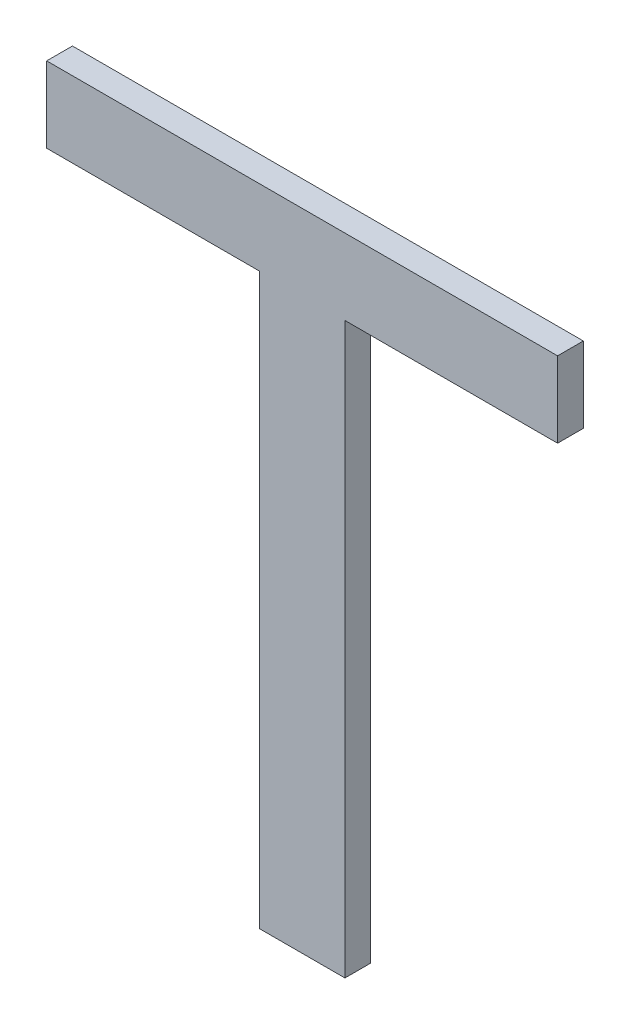
ISO-10303-21;
HEADER;
FILE_DESCRIPTION(('STEP AP214'),'2;1');
FILE_NAME('part.step','',(''),(''),'','','');
FILE_SCHEMA(('AUTOMOTIVE_DESIGN { 1 0 10303 214 1 1 1 1 }'));
ENDSEC;
DATA;
#1=APPLICATION_CONTEXT('core data for automotive mechanical design processes');
#2=APPLICATION_PROTOCOL_DEFINITION('international standard','automotive_design',2000,#1);
#3=PRODUCT_CONTEXT('',#1,'mechanical');
#4=PRODUCT('Part','Part','',(#3));
#5=PRODUCT_RELATED_PRODUCT_CATEGORY('part','',(#4));
#6=PRODUCT_DEFINITION_FORMATION('','',#4);
#7=PRODUCT_DEFINITION_CONTEXT('part definition',#1,'design');
#8=PRODUCT_DEFINITION('design','',#6,#7);
#9=PRODUCT_DEFINITION_SHAPE('','',#8);
#10=(LENGTH_UNIT() NAMED_UNIT(*) SI_UNIT(.MILLI.,.METRE.));
#11=(NAMED_UNIT(*) PLANE_ANGLE_UNIT() SI_UNIT($,.RADIAN.));
#12=(NAMED_UNIT(*) SI_UNIT($,.STERADIAN.) SOLID_ANGLE_UNIT());
#13=UNCERTAINTY_MEASURE_WITH_UNIT(LENGTH_MEASURE(1.E-05),#10,'distance_accuracy_value','');
#14=(GEOMETRIC_REPRESENTATION_CONTEXT(3) GLOBAL_UNCERTAINTY_ASSIGNED_CONTEXT((#13)) GLOBAL_UNIT_ASSIGNED_CONTEXT((#10,
#11,#12)) REPRESENTATION_CONTEXT('',''));
#15=CARTESIAN_POINT('',(0.,0.,0.));
#16=DIRECTION('',(0.,0.,1.));
#17=DIRECTION('',(1.,0.,0.));
#18=AXIS2_PLACEMENT_3D('',#15,#16,#17);
#19=CARTESIAN_POINT('',(-1.950772891939,0.0543411377222901,1.59999999404));
#20=DIRECTION('',(0.,0.,1.));
#21=DIRECTION('',(1.,0.,0.));
#22=AXIS2_PLACEMENT_3D('',#19,#20,#21);
#23=PLANE('',#22);
#24=DIRECTION('',(0.,1.,0.));
#25=VECTOR('',#24,1.);
#26=CARTESIAN_POINT('',(-1.752322901785,0.194164329953,1.59999999404));
#27=LINE('',#26,#25);
#28=CARTESIAN_POINT('',(-1.752322901785,0.223564329371,1.59999999404));
#29=VERTEX_POINT('',#28);
#30=CARTESIAN_POINT('',(-1.752322901785,0.164764330536,1.59999999404));
#31=VERTEX_POINT('',#30);
#32=EDGE_CURVE('E106',#29,#31,#27,.F.);
#33=ORIENTED_EDGE('',*,*,#32,.F.);
#34=DIRECTION('',(1.,0.,0.));
#35=VECTOR('',#34,1.);
#36=CARTESIAN_POINT('',(-1.950772891939,0.223564329371,1.59999999404));
#37=LINE('',#36,#35);
#38=CARTESIAN_POINT('',(-2.149222882092,0.223564329371,1.59999999404));
#39=VERTEX_POINT('',#38);
#40=EDGE_CURVE('E110',#39,#29,#37,.T.);
#41=ORIENTED_EDGE('',*,*,#40,.F.);
#42=DIRECTION('',(0.,1.,0.));
#43=VECTOR('',#42,1.);
#44=CARTESIAN_POINT('',(-2.149222882092,0.194164329953,1.59999999404));
#45=LINE('',#44,#43);
#46=CARTESIAN_POINT('',(-2.149222882092,0.164764330536,1.59999999404));
#47=VERTEX_POINT('',#46);
#48=EDGE_CURVE('E114',#47,#39,#45,.T.);
#49=ORIENTED_EDGE('',*,*,#48,.F.);
#50=DIRECTION('',(1.,0.,0.));
#51=VECTOR('',#50,1.);
#52=CARTESIAN_POINT('',(-2.066622848809,0.164764330536,1.59999999404));
#53=LINE('',#52,#51);
#54=CARTESIAN_POINT('',(-1.984022815526,0.164764330536,1.59999999404));
#55=VERTEX_POINT('',#54);
#56=EDGE_CURVE('E118',#55,#47,#53,.F.);
#57=ORIENTED_EDGE('',*,*,#56,.F.);
#58=DIRECTION('',(0.,1.,0.));
#59=VECTOR('',#58,1.);
#60=CARTESIAN_POINT('',(-1.984022815526,-0.0564356695860601,1.59999999404));
#61=LINE('',#60,#59);
#62=CARTESIAN_POINT('',(-1.984022815526,-0.277635669708,1.59999999404));
#63=VERTEX_POINT('',#62);
#64=EDGE_CURVE('E95',#63,#55,#61,.T.);
#65=ORIENTED_EDGE('',*,*,#64,.F.);
#66=DIRECTION('',(1.,0.,0.));
#67=VECTOR('',#66,1.);
#68=CARTESIAN_POINT('',(-1.950772891939,-0.277635669708,1.59999999404));
#69=LINE('',#68,#67);
#70=CARTESIAN_POINT('',(-1.917522968352,-0.277635669708,1.59999999404));
#71=VERTEX_POINT('',#70);
#72=EDGE_CURVE('E20',#71,#63,#69,.F.);
#73=ORIENTED_EDGE('',*,*,#72,.F.);
#74=DIRECTION('',(0.,1.,0.));
#75=VECTOR('',#74,1.);
#76=CARTESIAN_POINT('',(-1.917522968352,-0.05643566958606,1.59999999404));
#77=LINE('',#76,#75);
#78=CARTESIAN_POINT('',(-1.917522968352,0.164764330536,1.59999999404));
#79=VERTEX_POINT('',#78);
#80=EDGE_CURVE('E83',#79,#71,#77,.F.);
#81=ORIENTED_EDGE('',*,*,#80,.F.);
#82=DIRECTION('',(1.,0.,0.));
#83=VECTOR('',#82,1.);
#84=CARTESIAN_POINT('',(-1.834922935069,0.164764330536,1.59999999404));
#85=LINE('',#84,#83);
#86=EDGE_CURVE('E78',#31,#79,#85,.F.);
#87=ORIENTED_EDGE('',*,*,#86,.F.);
#88=EDGE_LOOP('',(#33,#41,#49,#57,#65,#73,#81,#87));
#89=FACE_BOUND('',#88,.T.);
#90=ADVANCED_FACE('F17',(#89),#23,.T.);
#91=CARTESIAN_POINT('',(-1.950772891939,-0.277635669708,1.59999999404));
#92=DIRECTION('',(0.,-1.,0.));
#93=DIRECTION('',(0.,0.,-1.));
#94=AXIS2_PLACEMENT_3D('',#91,#92,#93);
#95=PLANE('',#94);
#96=DIRECTION('',(1.,0.,0.));
#97=VECTOR('',#96,1.);
#98=CARTESIAN_POINT('',(-1.950772891939,-0.277635669708,1.57999999404));
#99=LINE('',#98,#97);
#100=CARTESIAN_POINT('',(-1.984022815526,-0.277635669708,1.57999999404));
#101=VERTEX_POINT('',#100);
#102=CARTESIAN_POINT('',(-1.917522968352,-0.277635669708,1.57999999404));
#103=VERTEX_POINT('',#102);
#104=EDGE_CURVE('E101',#101,#103,#99,.T.);
#105=ORIENTED_EDGE('',*,*,#104,.T.);
#106=DIRECTION('',(0.,0.,-1.));
#107=VECTOR('',#106,1.);
#108=CARTESIAN_POINT('',(-1.917522968352,-0.277635669708,1.59999999404));
#109=LINE('',#108,#107);
#110=EDGE_CURVE('E88',#71,#103,#109,.T.);
#111=ORIENTED_EDGE('',*,*,#110,.F.);
#112=ORIENTED_EDGE('',*,*,#72,.T.);
#113=DIRECTION('',(0.,0.,1.));
#114=VECTOR('',#113,1.);
#115=CARTESIAN_POINT('',(-1.984022815526,-0.277635669708,1.59999999404));
#116=LINE('',#115,#114);
#117=EDGE_CURVE('E124',#101,#63,#116,.T.);
#118=ORIENTED_EDGE('',*,*,#117,.F.);
#119=EDGE_LOOP('',(#105,#111,#112,#118));
#120=FACE_BOUND('',#119,.T.);
#121=ADVANCED_FACE('F100',(#120),#95,.T.);
#122=CARTESIAN_POINT('',(-1.917522968352,-0.05643566958606,1.59999999404));
#123=DIRECTION('',(1.,0.,0.));
#124=DIRECTION('',(0.,0.,-1.));
#125=AXIS2_PLACEMENT_3D('',#122,#123,#124);
#126=PLANE('',#125);
#127=DIRECTION('',(0.,1.,0.));
#128=VECTOR('',#127,1.);
#129=CARTESIAN_POINT('',(-1.917522968352,0.0543411377222901,1.57999999404));
#130=LINE('',#129,#128);
#131=CARTESIAN_POINT('',(-1.917522968352,0.164764330536,1.57999999404));
#132=VERTEX_POINT('',#131);
#133=EDGE_CURVE('E127',#103,#132,#130,.T.);
#134=ORIENTED_EDGE('',*,*,#133,.T.);
#135=DIRECTION('',(0.,0.,-1.));
#136=VECTOR('',#135,1.);
#137=CARTESIAN_POINT('',(-1.917522968352,0.164764330536,1.59999999404));
#138=LINE('',#137,#136);
#139=EDGE_CURVE('E90',#79,#132,#138,.T.);
#140=ORIENTED_EDGE('',*,*,#139,.F.);
#141=ORIENTED_EDGE('',*,*,#80,.T.);
#142=ORIENTED_EDGE('',*,*,#110,.T.);
#143=EDGE_LOOP('',(#134,#140,#141,#142));
#144=FACE_BOUND('',#143,.T.);
#145=ADVANCED_FACE('F86',(#144),#126,.T.);
#146=CARTESIAN_POINT('',(-1.834922935069,0.164764330536,1.59999999404));
#147=DIRECTION('',(0.,-1.,0.));
#148=DIRECTION('',(0.,0.,-1.));
#149=AXIS2_PLACEMENT_3D('',#146,#147,#148);
#150=PLANE('',#149);
#151=DIRECTION('',(1.,0.,0.));
#152=VECTOR('',#151,1.);
#153=CARTESIAN_POINT('',(-1.950772891939,0.164764330536,1.57999999404));
#154=LINE('',#153,#152);
#155=CARTESIAN_POINT('',(-1.752322901785,0.164764330536,1.57999999404));
#156=VERTEX_POINT('',#155);
#157=EDGE_CURVE('E129',#132,#156,#154,.T.);
#158=ORIENTED_EDGE('',*,*,#157,.T.);
#159=DIRECTION('',(0.,0.,-1.));
#160=VECTOR('',#159,1.);
#161=CARTESIAN_POINT('',(-1.752322901785,0.164764330536,1.59999999404));
#162=LINE('',#161,#160);
#163=EDGE_CURVE('E108',#31,#156,#162,.T.);
#164=ORIENTED_EDGE('',*,*,#163,.F.);
#165=ORIENTED_EDGE('',*,*,#86,.T.);
#166=ORIENTED_EDGE('',*,*,#139,.T.);
#167=EDGE_LOOP('',(#158,#164,#165,#166));
#168=FACE_BOUND('',#167,.T.);
#169=ADVANCED_FACE('F162',(#168),#150,.T.);
#170=CARTESIAN_POINT('',(-1.752322901785,0.194164329953,1.59999999404));
#171=DIRECTION('',(1.,0.,0.));
#172=DIRECTION('',(0.,0.,-1.));
#173=AXIS2_PLACEMENT_3D('',#170,#171,#172);
#174=PLANE('',#173);
#175=DIRECTION('',(0.,1.,0.));
#176=VECTOR('',#175,1.);
#177=CARTESIAN_POINT('',(-1.752322901785,0.0543411377222901,1.57999999404));
#178=LINE('',#177,#176);
#179=CARTESIAN_POINT('',(-1.752322901785,0.223564329371,1.57999999404));
#180=VERTEX_POINT('',#179);
#181=EDGE_CURVE('E132',#156,#180,#178,.T.);
#182=ORIENTED_EDGE('',*,*,#181,.T.);
#183=DIRECTION('',(0.,0.,1.));
#184=VECTOR('',#183,1.);
#185=CARTESIAN_POINT('',(-1.752322901785,0.223564329371,1.59999999404));
#186=LINE('',#185,#184);
#187=EDGE_CURVE('E112',#29,#180,#186,.F.);
#188=ORIENTED_EDGE('',*,*,#187,.F.);
#189=ORIENTED_EDGE('',*,*,#32,.T.);
#190=ORIENTED_EDGE('',*,*,#163,.T.);
#191=EDGE_LOOP('',(#182,#188,#189,#190));
#192=FACE_BOUND('',#191,.T.);
#193=ADVANCED_FACE('F161',(#192),#174,.T.);
#194=CARTESIAN_POINT('',(-1.950772891939,0.223564329371,1.59999999404));
#195=DIRECTION('',(0.,1.,0.));
#196=DIRECTION('',(0.,0.,1.));
#197=AXIS2_PLACEMENT_3D('',#194,#195,#196);
#198=PLANE('',#197);
#199=DIRECTION('',(1.,0.,0.));
#200=VECTOR('',#199,1.);
#201=CARTESIAN_POINT('',(-1.950772891939,0.223564329371,1.57999999404));
#202=LINE('',#201,#200);
#203=CARTESIAN_POINT('',(-2.149222882092,0.223564329371,1.57999999404));
#204=VERTEX_POINT('',#203);
#205=EDGE_CURVE('E135',#180,#204,#202,.F.);
#206=ORIENTED_EDGE('',*,*,#205,.T.);
#207=DIRECTION('',(0.,0.,1.));
#208=VECTOR('',#207,1.);
#209=CARTESIAN_POINT('',(-2.149222882092,0.223564329371,1.59999999404));
#210=LINE('',#209,#208);
#211=EDGE_CURVE('E116',#39,#204,#210,.F.);
#212=ORIENTED_EDGE('',*,*,#211,.F.);
#213=ORIENTED_EDGE('',*,*,#40,.T.);
#214=ORIENTED_EDGE('',*,*,#187,.T.);
#215=EDGE_LOOP('',(#206,#212,#213,#214));
#216=FACE_BOUND('',#215,.T.);
#217=ADVANCED_FACE('F156',(#216),#198,.T.);
#218=CARTESIAN_POINT('',(-2.149222882092,0.194164329953,1.59999999404));
#219=DIRECTION('',(-1.,0.,0.));
#220=DIRECTION('',(0.,0.,1.));
#221=AXIS2_PLACEMENT_3D('',#218,#219,#220);
#222=PLANE('',#221);
#223=DIRECTION('',(0.,1.,0.));
#224=VECTOR('',#223,1.);
#225=CARTESIAN_POINT('',(-2.149222882092,0.0543411377222902,1.57999999404));
#226=LINE('',#225,#224);
#227=CARTESIAN_POINT('',(-2.149222882092,0.164764330536,1.57999999404));
#228=VERTEX_POINT('',#227);
#229=EDGE_CURVE('E138',#204,#228,#226,.F.);
#230=ORIENTED_EDGE('',*,*,#229,.T.);
#231=DIRECTION('',(0.,0.,-1.));
#232=VECTOR('',#231,1.);
#233=CARTESIAN_POINT('',(-2.149222882092,0.164764330536,1.59999999404));
#234=LINE('',#233,#232);
#235=EDGE_CURVE('E120',#47,#228,#234,.T.);
#236=ORIENTED_EDGE('',*,*,#235,.F.);
#237=ORIENTED_EDGE('',*,*,#48,.T.);
#238=ORIENTED_EDGE('',*,*,#211,.T.);
#239=EDGE_LOOP('',(#230,#236,#237,#238));
#240=FACE_BOUND('',#239,.T.);
#241=ADVANCED_FACE('F151',(#240),#222,.T.);
#242=CARTESIAN_POINT('',(-2.066622848809,0.164764330536,1.59999999404));
#243=DIRECTION('',(0.,-1.,0.));
#244=DIRECTION('',(0.,0.,-1.));
#245=AXIS2_PLACEMENT_3D('',#242,#243,#244);
#246=PLANE('',#245);
#247=DIRECTION('',(1.,0.,0.));
#248=VECTOR('',#247,1.);
#249=CARTESIAN_POINT('',(-1.950772891939,0.164764330536,1.57999999404));
#250=LINE('',#249,#248);
#251=CARTESIAN_POINT('',(-1.984022815526,0.164764330536,1.57999999404));
#252=VERTEX_POINT('',#251);
#253=EDGE_CURVE('E26',#228,#252,#250,.T.);
#254=ORIENTED_EDGE('',*,*,#253,.T.);
#255=DIRECTION('',(0.,0.,1.));
#256=VECTOR('',#255,1.);
#257=CARTESIAN_POINT('',(-1.984022815526,0.164764330536,1.59999999404));
#258=LINE('',#257,#256);
#259=EDGE_CURVE('E34',#55,#252,#258,.F.);
#260=ORIENTED_EDGE('',*,*,#259,.F.);
#261=ORIENTED_EDGE('',*,*,#56,.T.);
#262=ORIENTED_EDGE('',*,*,#235,.T.);
#263=EDGE_LOOP('',(#254,#260,#261,#262));
#264=FACE_BOUND('',#263,.T.);
#265=ADVANCED_FACE('F144',(#264),#246,.T.);
#266=CARTESIAN_POINT('',(-1.984022815526,-0.0564356695860601,1.59999999404));
#267=DIRECTION('',(-1.,0.,0.));
#268=DIRECTION('',(0.,0.,1.));
#269=AXIS2_PLACEMENT_3D('',#266,#267,#268);
#270=PLANE('',#269);
#271=DIRECTION('',(0.,1.,0.));
#272=VECTOR('',#271,1.);
#273=CARTESIAN_POINT('',(-1.984022815526,0.0543411377222902,1.57999999404));
#274=LINE('',#273,#272);
#275=EDGE_CURVE('E11',#252,#101,#274,.F.);
#276=ORIENTED_EDGE('',*,*,#275,.T.);
#277=ORIENTED_EDGE('',*,*,#117,.T.);
#278=ORIENTED_EDGE('',*,*,#64,.T.);
#279=ORIENTED_EDGE('',*,*,#259,.T.);
#280=EDGE_LOOP('',(#276,#277,#278,#279));
#281=FACE_BOUND('',#280,.T.);
#282=ADVANCED_FACE('F163',(#281),#270,.T.);
#283=CARTESIAN_POINT('',(-1.950772891939,0.0543411377222901,1.57999999404));
#284=DIRECTION('',(0.,0.,1.));
#285=DIRECTION('',(1.,0.,0.));
#286=AXIS2_PLACEMENT_3D('',#283,#284,#285);
#287=PLANE('',#286);
#288=ORIENTED_EDGE('',*,*,#253,.F.);
#289=ORIENTED_EDGE('',*,*,#229,.F.);
#290=ORIENTED_EDGE('',*,*,#205,.F.);
#291=ORIENTED_EDGE('',*,*,#181,.F.);
#292=ORIENTED_EDGE('',*,*,#157,.F.);
#293=ORIENTED_EDGE('',*,*,#133,.F.);
#294=ORIENTED_EDGE('',*,*,#104,.F.);
#295=ORIENTED_EDGE('',*,*,#275,.F.);
#296=EDGE_LOOP('',(#288,#289,#290,#291,#292,#293,#294,#295));
#297=FACE_BOUND('',#296,.T.);
#298=ADVANCED_FACE('F148',(#297),#287,.F.);
#299=CLOSED_SHELL('',(#90,#121,#145,#169,#193,#217,#241,#265,#282,#298));
#300=MANIFOLD_SOLID_BREP('B1',#299);
#301=ADVANCED_BREP_SHAPE_REPRESENTATION('',(#18,#300),#14);
#302=SHAPE_DEFINITION_REPRESENTATION(#9,#301);
ENDSEC;
END-ISO-10303-21;
